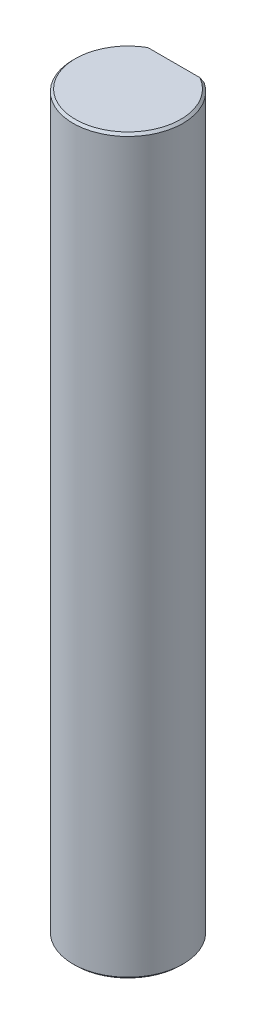
ISO-10303-21;
HEADER;
FILE_DESCRIPTION(('STEP AP214'),'2;1');
FILE_NAME('part.step','',(''),(''),'','','');
FILE_SCHEMA(('AUTOMOTIVE_DESIGN { 1 0 10303 214 1 1 1 1 }'));
ENDSEC;
DATA;
#1=APPLICATION_CONTEXT('core data for automotive mechanical design processes');
#2=APPLICATION_PROTOCOL_DEFINITION('international standard','automotive_design',2000,#1);
#3=PRODUCT_CONTEXT('',#1,'mechanical');
#4=PRODUCT('Part','Part','',(#3));
#5=PRODUCT_RELATED_PRODUCT_CATEGORY('part','',(#4));
#6=PRODUCT_DEFINITION_FORMATION('','',#4);
#7=PRODUCT_DEFINITION_CONTEXT('part definition',#1,'design');
#8=PRODUCT_DEFINITION('design','',#6,#7);
#9=PRODUCT_DEFINITION_SHAPE('','',#8);
#10=(LENGTH_UNIT() NAMED_UNIT(*) SI_UNIT(.MILLI.,.METRE.));
#11=(NAMED_UNIT(*) PLANE_ANGLE_UNIT() SI_UNIT($,.RADIAN.));
#12=(NAMED_UNIT(*) SI_UNIT($,.STERADIAN.) SOLID_ANGLE_UNIT());
#13=UNCERTAINTY_MEASURE_WITH_UNIT(LENGTH_MEASURE(1.E-05),#10,'distance_accuracy_value','');
#14=(GEOMETRIC_REPRESENTATION_CONTEXT(3) GLOBAL_UNCERTAINTY_ASSIGNED_CONTEXT((#13)) GLOBAL_UNIT_ASSIGNED_CONTEXT((#10,
#11,#12)) REPRESENTATION_CONTEXT('',''));
#15=CARTESIAN_POINT('',(0.,0.,0.));
#16=DIRECTION('',(0.,0.,1.));
#17=DIRECTION('',(1.,0.,0.));
#18=AXIS2_PLACEMENT_3D('',#15,#16,#17);
#19=CARTESIAN_POINT('',(0.,40.,0.));
#20=DIRECTION('',(0.,-1.,0.));
#21=DIRECTION('',(0.,0.,-1.));
#22=AXIS2_PLACEMENT_3D('',#19,#20,#21);
#23=CONICAL_SURFACE('',#22,2.875,0.785398163397453);
#24=CARTESIAN_POINT('',(-1.6583123951777,39.875,-2.5));
#25=CARTESIAN_POINT('',(-1.57973572193476,39.9184348904036,-2.5));
#26=CARTESIAN_POINT('',(-1.50022900034241,39.9602466964648,-2.5));
#27=CARTESIAN_POINT('',(-1.41972708645008,40.,-2.5));
#28=(BOUNDED_CURVE() B_SPLINE_CURVE(3,(#24,#25,#26,#27),.UNSPECIFIED.,.F.,
.F.) B_SPLINE_CURVE_WITH_KNOTS((4,4),(0.,0.000269347265701087),
.UNSPECIFIED.) CURVE() GEOMETRIC_REPRESENTATION_ITEM() RATIONAL_B_SPLINE_CURVE((1.,1.,1.,1.)) REPRESENTATION_ITEM(''));
#29=CARTESIAN_POINT('',(-1.6583123951777,39.875,-2.5));
#30=VERTEX_POINT('',#29);
#31=CARTESIAN_POINT('',(-1.41972708645008,40.,-2.5));
#32=VERTEX_POINT('',#31);
#33=EDGE_CURVE('E107',#30,#32,#28,.T.);
#34=ORIENTED_EDGE('',*,*,#33,.F.);
#35=CARTESIAN_POINT('',(0.,39.875,0.));
#36=DIRECTION('',(0.,-1.,0.));
#37=DIRECTION('',(0.,0.,1.));
#38=AXIS2_PLACEMENT_3D('',#35,#36,#37);
#39=CIRCLE('',#38,3.);
#40=CARTESIAN_POINT('',(1.6583123951777,39.875,-2.5));
#41=VERTEX_POINT('',#40);
#42=EDGE_CURVE('E140',#41,#30,#39,.T.);
#43=ORIENTED_EDGE('',*,*,#42,.F.);
#44=CARTESIAN_POINT('',(1.41972708645008,40.,-2.5));
#45=CARTESIAN_POINT('',(1.50022900034239,39.9602466964647,-2.5));
#46=CARTESIAN_POINT('',(1.57973572193477,39.9184348904036,-2.5));
#47=CARTESIAN_POINT('',(1.6583123951777,39.875,-2.5));
#48=(BOUNDED_CURVE() B_SPLINE_CURVE(3,(#44,#45,#46,#47),.UNSPECIFIED.,.F.,
.F.) B_SPLINE_CURVE_WITH_KNOTS((4,4),(0.,0.000269347265701088),
.UNSPECIFIED.) CURVE() GEOMETRIC_REPRESENTATION_ITEM() RATIONAL_B_SPLINE_CURVE((1.,1.,1.,1.)) REPRESENTATION_ITEM(''));
#49=CARTESIAN_POINT('',(1.41972708645008,40.,-2.5));
#50=VERTEX_POINT('',#49);
#51=EDGE_CURVE('E19',#50,#41,#48,.T.);
#52=ORIENTED_EDGE('',*,*,#51,.F.);
#53=CARTESIAN_POINT('',(0.,40.,0.));
#54=DIRECTION('',(0.,1.,0.));
#55=DIRECTION('',(0.,0.,1.));
#56=AXIS2_PLACEMENT_3D('',#53,#54,#55);
#57=CIRCLE('',#56,2.875);
#58=EDGE_CURVE('E27',#32,#50,#57,.T.);
#59=ORIENTED_EDGE('',*,*,#58,.F.);
#60=EDGE_LOOP('',(#34,#43,#52,#59));
#61=FACE_BOUND('',#60,.T.);
#62=ADVANCED_FACE('F15',(#61),#23,.T.);
#63=CARTESIAN_POINT('',(0.,0.125,0.));
#64=DIRECTION('',(0.,1.,0.));
#65=DIRECTION('',(0.,0.,1.));
#66=AXIS2_PLACEMENT_3D('',#63,#64,#65);
#67=CONICAL_SURFACE('',#66,3.,0.785398163397452);
#68=DIRECTION('',(0.,0.707106781186545,0.70710678118655));
#69=VECTOR('',#68,1.);
#70=CARTESIAN_POINT('',(0.,0.125,3.));
#71=LINE('',#70,#69);
#72=CARTESIAN_POINT('',(0.,0.,2.875));
#73=VERTEX_POINT('',#72);
#74=CARTESIAN_POINT('',(0.,0.125,3.));
#75=VERTEX_POINT('',#74);
#76=EDGE_CURVE('E89',#73,#75,#71,.T.);
#77=ORIENTED_EDGE('',*,*,#76,.F.);
#78=CARTESIAN_POINT('',(0.,0.,0.));
#79=DIRECTION('',(0.,-1.,0.));
#80=DIRECTION('',(0.,0.,1.));
#81=AXIS2_PLACEMENT_3D('',#78,#79,#80);
#82=CIRCLE('',#81,2.875);
#83=CARTESIAN_POINT('',(1.41972708645007,0.,-2.5));
#84=VERTEX_POINT('',#83);
#85=EDGE_CURVE('E10',#84,#73,#82,.T.);
#86=ORIENTED_EDGE('',*,*,#85,.F.);
#87=CARTESIAN_POINT('',(1.6583123951777,0.125,-2.5));
#88=CARTESIAN_POINT('',(1.57973572193476,0.081565109596466,-2.5));
#89=CARTESIAN_POINT('',(1.5002290003424,0.0397533035352765,-2.5));
#90=CARTESIAN_POINT('',(1.41972708645007,0.,-2.5));
#91=(BOUNDED_CURVE() B_SPLINE_CURVE(3,(#87,#88,#89,#90),.UNSPECIFIED.,.F.,
.F.) B_SPLINE_CURVE_WITH_KNOTS((4,4),(0.,0.000269347265701103),
.UNSPECIFIED.) CURVE() GEOMETRIC_REPRESENTATION_ITEM() RATIONAL_B_SPLINE_CURVE((1.,1.,1.,1.)) REPRESENTATION_ITEM(''));
#92=CARTESIAN_POINT('',(1.6583123951777,0.125,-2.5));
#93=VERTEX_POINT('',#92);
#94=EDGE_CURVE('E144',#93,#84,#91,.T.);
#95=ORIENTED_EDGE('',*,*,#94,.F.);
#96=CARTESIAN_POINT('',(0.,0.125,0.));
#97=DIRECTION('',(0.,1.,0.));
#98=DIRECTION('',(0.,0.,1.));
#99=AXIS2_PLACEMENT_3D('',#96,#97,#98);
#100=CIRCLE('',#99,3.);
#101=EDGE_CURVE('E91',#75,#93,#100,.T.);
#102=ORIENTED_EDGE('',*,*,#101,.F.);
#103=EDGE_LOOP('',(#77,#86,#95,#102));
#104=FACE_BOUND('',#103,.T.);
#105=ADVANCED_FACE('F17',(#104),#67,.T.);
#106=CARTESIAN_POINT('',(0.,0.,0.));
#107=DIRECTION('',(0.,1.,0.));
#108=DIRECTION('',(1.,0.,0.));
#109=AXIS2_PLACEMENT_3D('',#106,#107,#108);
#110=PLANE('',#109);
#111=DIRECTION('',(1.,0.,0.));
#112=VECTOR('',#111,1.);
#113=CARTESIAN_POINT('',(0.,0.,-2.5));
#114=LINE('',#113,#112);
#115=CARTESIAN_POINT('',(-1.41972708645007,0.,-2.5));
#116=VERTEX_POINT('',#115);
#117=EDGE_CURVE('E85',#116,#84,#114,.T.);
#118=ORIENTED_EDGE('',*,*,#117,.T.);
#119=ORIENTED_EDGE('',*,*,#85,.T.);
#120=CARTESIAN_POINT('',(0.,0.,0.));
#121=DIRECTION('',(0.,-1.,0.));
#122=DIRECTION('',(0.,0.,1.));
#123=AXIS2_PLACEMENT_3D('',#120,#121,#122);
#124=CIRCLE('',#123,2.875);
#125=EDGE_CURVE('E84',#73,#116,#124,.T.);
#126=ORIENTED_EDGE('',*,*,#125,.T.);
#127=EDGE_LOOP('',(#118,#119,#126));
#128=FACE_BOUND('',#127,.T.);
#129=ADVANCED_FACE('F82',(#128),#110,.F.);
#130=CARTESIAN_POINT('',(0.,40.,0.));
#131=DIRECTION('',(0.,1.,0.));
#132=DIRECTION('',(1.,0.,0.));
#133=AXIS2_PLACEMENT_3D('',#130,#131,#132);
#134=PLANE('',#133);
#135=DIRECTION('',(1.,0.,0.));
#136=VECTOR('',#135,1.);
#137=CARTESIAN_POINT('',(0.,40.,-2.5));
#138=LINE('',#137,#136);
#139=EDGE_CURVE('E112',#32,#50,#138,.T.);
#140=ORIENTED_EDGE('',*,*,#139,.F.);
#141=ORIENTED_EDGE('',*,*,#58,.T.);
#142=EDGE_LOOP('',(#140,#141));
#143=FACE_BOUND('',#142,.T.);
#144=ADVANCED_FACE('F232',(#143),#134,.T.);
#145=CARTESIAN_POINT('',(0.,40.,-2.5));
#146=DIRECTION('',(0.,0.,-1.));
#147=DIRECTION('',(0.,-1.,0.));
#148=AXIS2_PLACEMENT_3D('',#145,#146,#147);
#149=PLANE('',#148);
#150=DIRECTION('',(0.,-1.,0.));
#151=VECTOR('',#150,1.);
#152=CARTESIAN_POINT('',(1.6583123951777,40.,-2.5));
#153=LINE('',#152,#151);
#154=EDGE_CURVE('E136',#41,#93,#153,.T.);
#155=ORIENTED_EDGE('',*,*,#154,.T.);
#156=ORIENTED_EDGE('',*,*,#94,.T.);
#157=ORIENTED_EDGE('',*,*,#117,.F.);
#158=CARTESIAN_POINT('',(-1.41972708645007,0.,-2.5));
#159=CARTESIAN_POINT('',(-1.50022900034238,0.0397533035353011,-2.5));
#160=CARTESIAN_POINT('',(-1.57973572193476,0.0815651095964537,-2.5));
#161=CARTESIAN_POINT('',(-1.6583123951777,0.125,-2.5));
#162=(BOUNDED_CURVE() B_SPLINE_CURVE(3,(#158,#159,#160,#161),.UNSPECIFIED.,.F.,
.F.) B_SPLINE_CURVE_WITH_KNOTS((4,4),(0.,0.000269347265701102),
.UNSPECIFIED.) CURVE() GEOMETRIC_REPRESENTATION_ITEM() RATIONAL_B_SPLINE_CURVE((1.,1.,1.,1.)) REPRESENTATION_ITEM(''));
#163=CARTESIAN_POINT('',(-1.6583123951777,0.125,-2.5));
#164=VERTEX_POINT('',#163);
#165=EDGE_CURVE('E101',#116,#164,#162,.T.);
#166=ORIENTED_EDGE('',*,*,#165,.T.);
#167=DIRECTION('',(0.,-1.,0.));
#168=VECTOR('',#167,1.);
#169=CARTESIAN_POINT('',(-1.6583123951777,40.,-2.5));
#170=LINE('',#169,#168);
#171=EDGE_CURVE('E125',#30,#164,#170,.T.);
#172=ORIENTED_EDGE('',*,*,#171,.F.);
#173=ORIENTED_EDGE('',*,*,#33,.T.);
#174=ORIENTED_EDGE('',*,*,#139,.T.);
#175=ORIENTED_EDGE('',*,*,#51,.T.);
#176=EDGE_LOOP('',(#155,#156,#157,#166,#172,#173,#174,#175));
#177=FACE_BOUND('',#176,.T.);
#178=ADVANCED_FACE('F223',(#177),#149,.T.);
#179=CARTESIAN_POINT('',(0.,40.,0.));
#180=DIRECTION('',(0.,-1.,0.));
#181=DIRECTION('',(0.,0.,-1.));
#182=AXIS2_PLACEMENT_3D('',#179,#180,#181);
#183=CYLINDRICAL_SURFACE('',#182,3.);
#184=ORIENTED_EDGE('',*,*,#171,.T.);
#185=CARTESIAN_POINT('',(0.,0.125,0.));
#186=DIRECTION('',(0.,1.,0.));
#187=DIRECTION('',(0.,0.,1.));
#188=AXIS2_PLACEMENT_3D('',#185,#186,#187);
#189=CIRCLE('',#188,3.);
#190=EDGE_CURVE('E96',#164,#75,#189,.T.);
#191=ORIENTED_EDGE('',*,*,#190,.T.);
#192=ORIENTED_EDGE('',*,*,#101,.T.);
#193=ORIENTED_EDGE('',*,*,#154,.F.);
#194=ORIENTED_EDGE('',*,*,#42,.T.);
#195=EDGE_LOOP('',(#184,#191,#192,#193,#194));
#196=FACE_BOUND('',#195,.T.);
#197=ADVANCED_FACE('F215',(#196),#183,.T.);
#198=CARTESIAN_POINT('',(0.,0.125,0.));
#199=DIRECTION('',(0.,1.,0.));
#200=DIRECTION('',(0.,0.,1.));
#201=AXIS2_PLACEMENT_3D('',#198,#199,#200);
#202=CONICAL_SURFACE('',#201,3.,0.785398163397452);
#203=ORIENTED_EDGE('',*,*,#125,.F.);
#204=ORIENTED_EDGE('',*,*,#76,.T.);
#205=ORIENTED_EDGE('',*,*,#190,.F.);
#206=ORIENTED_EDGE('',*,*,#165,.F.);
#207=EDGE_LOOP('',(#203,#204,#205,#206));
#208=FACE_BOUND('',#207,.T.);
#209=ADVANCED_FACE('F99',(#208),#202,.T.);
#210=CLOSED_SHELL('',(#62,#105,#129,#144,#178,#197,#209));
#211=MANIFOLD_SOLID_BREP('B1',#210);
#212=ADVANCED_BREP_SHAPE_REPRESENTATION('',(#18,#211),#14);
#213=SHAPE_DEFINITION_REPRESENTATION(#9,#212);
ENDSEC;
END-ISO-10303-21;
